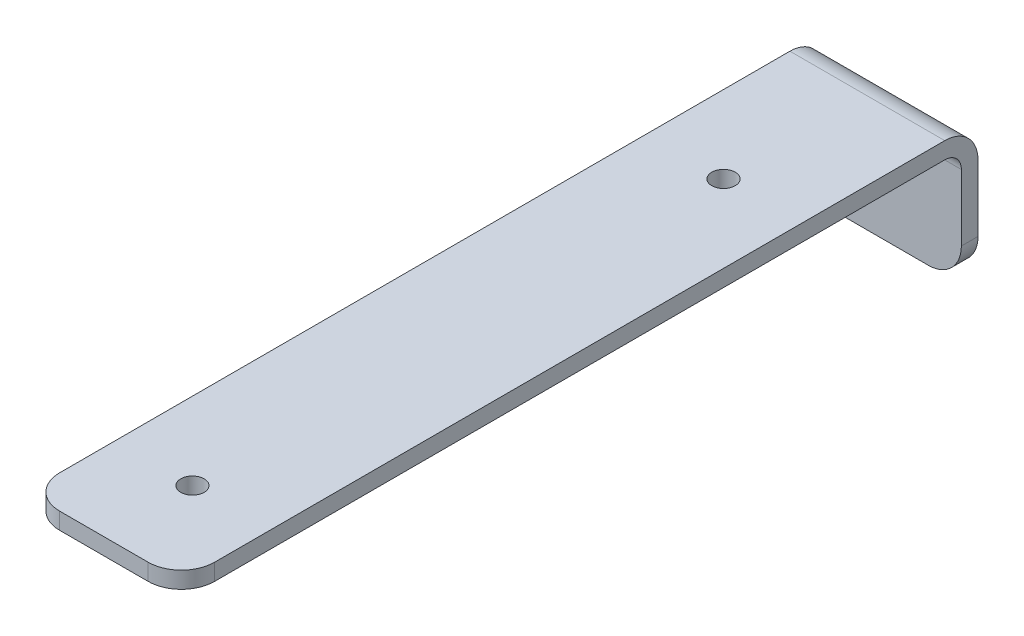
ISO-10303-21;
HEADER;
FILE_DESCRIPTION(('STEP AP214'),'2;1');
FILE_NAME('part.step','',(''),(''),'','','');
FILE_SCHEMA(('AUTOMOTIVE_DESIGN { 1 0 10303 214 1 1 1 1 }'));
ENDSEC;
DATA;
#1=APPLICATION_CONTEXT('core data for automotive mechanical design processes');
#2=APPLICATION_PROTOCOL_DEFINITION('international standard','automotive_design',2000,#1);
#3=PRODUCT_CONTEXT('',#1,'mechanical');
#4=PRODUCT('Part','Part','',(#3));
#5=PRODUCT_RELATED_PRODUCT_CATEGORY('part','',(#4));
#6=PRODUCT_DEFINITION_FORMATION('','',#4);
#7=PRODUCT_DEFINITION_CONTEXT('part definition',#1,'design');
#8=PRODUCT_DEFINITION('design','',#6,#7);
#9=PRODUCT_DEFINITION_SHAPE('','',#8);
#10=(LENGTH_UNIT() NAMED_UNIT(*) SI_UNIT(.MILLI.,.METRE.));
#11=(NAMED_UNIT(*) PLANE_ANGLE_UNIT() SI_UNIT($,.RADIAN.));
#12=(NAMED_UNIT(*) SI_UNIT($,.STERADIAN.) SOLID_ANGLE_UNIT());
#13=UNCERTAINTY_MEASURE_WITH_UNIT(LENGTH_MEASURE(1.E-05),#10,'distance_accuracy_value','');
#14=(GEOMETRIC_REPRESENTATION_CONTEXT(3) GLOBAL_UNCERTAINTY_ASSIGNED_CONTEXT((#13)) GLOBAL_UNIT_ASSIGNED_CONTEXT((#10,
#11,#12)) REPRESENTATION_CONTEXT('',''));
#15=CARTESIAN_POINT('',(0.,0.,0.));
#16=DIRECTION('',(0.,0.,1.));
#17=DIRECTION('',(1.,0.,0.));
#18=AXIS2_PLACEMENT_3D('',#15,#16,#17);
#19=CARTESIAN_POINT('',(44.45,0.,-4.7752));
#20=DIRECTION('',(0.,1.,0.));
#21=DIRECTION('',(0.,0.,1.));
#22=AXIS2_PLACEMENT_3D('',#19,#20,#21);
#23=PLANE('',#22);
#24=DIRECTION('',(-1.,0.,0.));
#25=VECTOR('',#24,1.);
#26=CARTESIAN_POINT('',(44.45,0.,0.));
#27=LINE('',#26,#25);
#28=CARTESIAN_POINT('',(34.925,0.,0.));
#29=VERTEX_POINT('',#28);
#30=CARTESIAN_POINT('',(9.525,0.,0.));
#31=VERTEX_POINT('',#30);
#32=EDGE_CURVE('E159',#29,#31,#27,.T.);
#33=ORIENTED_EDGE('',*,*,#32,.T.);
#34=DIRECTION('',(0.,0.,-1.));
#35=VECTOR('',#34,1.);
#36=CARTESIAN_POINT('',(9.525,0.,-4.7752));
#37=LINE('',#36,#35);
#38=CARTESIAN_POINT('',(9.525,0.,-4.7752));
#39=VERTEX_POINT('',#38);
#40=EDGE_CURVE('E184',#31,#39,#37,.T.);
#41=ORIENTED_EDGE('',*,*,#40,.T.);
#42=DIRECTION('',(-1.,0.,0.));
#43=VECTOR('',#42,1.);
#44=CARTESIAN_POINT('',(44.45,0.,-4.7752));
#45=LINE('',#44,#43);
#46=CARTESIAN_POINT('',(34.925,0.,-4.7752));
#47=VERTEX_POINT('',#46);
#48=EDGE_CURVE('E144',#47,#39,#45,.T.);
#49=ORIENTED_EDGE('',*,*,#48,.F.);
#50=DIRECTION('',(0.,0.,-1.));
#51=VECTOR('',#50,1.);
#52=CARTESIAN_POINT('',(34.925,0.,-4.7752));
#53=LINE('',#52,#51);
#54=EDGE_CURVE('E182',#47,#29,#53,.F.);
#55=ORIENTED_EDGE('',*,*,#54,.T.);
#56=EDGE_LOOP('',(#33,#41,#49,#55));
#57=FACE_BOUND('',#56,.T.);
#58=ADVANCED_FACE('F32',(#57),#23,.F.);
#59=CARTESIAN_POINT('',(44.45,38.1,-4.7752));
#60=DIRECTION('',(0.,0.,1.));
#61=DIRECTION('',(0.,-1.,0.));
#62=AXIS2_PLACEMENT_3D('',#59,#60,#61);
#63=PLANE('',#62);
#64=ORIENTED_EDGE('',*,*,#48,.T.);
#65=CARTESIAN_POINT('',(9.525,9.525,-4.7752));
#66=DIRECTION('',(0.,0.,1.));
#67=DIRECTION('',(0.,-1.,0.));
#68=AXIS2_PLACEMENT_3D('',#65,#66,#67);
#69=CIRCLE('',#68,9.525);
#70=CARTESIAN_POINT('',(0.,9.52500000000001,-4.7752));
#71=VERTEX_POINT('',#70);
#72=EDGE_CURVE('E189',#39,#71,#69,.F.);
#73=ORIENTED_EDGE('',*,*,#72,.T.);
#74=DIRECTION('',(0.,1.,0.));
#75=VECTOR('',#74,1.);
#76=CARTESIAN_POINT('',(0.,38.1,-4.7752));
#77=LINE('',#76,#75);
#78=CARTESIAN_POINT('',(0.,28.575,-4.7752));
#79=VERTEX_POINT('',#78);
#80=EDGE_CURVE('E218',#71,#79,#77,.T.);
#81=ORIENTED_EDGE('',*,*,#80,.T.);
#82=DIRECTION('',(-1.,0.,0.));
#83=VECTOR('',#82,1.);
#84=CARTESIAN_POINT('',(44.45,28.575,-4.7752));
#85=LINE('',#84,#83);
#86=CARTESIAN_POINT('',(44.45,28.575,-4.7752));
#87=VERTEX_POINT('',#86);
#88=EDGE_CURVE('E177',#79,#87,#85,.F.);
#89=ORIENTED_EDGE('',*,*,#88,.T.);
#90=DIRECTION('',(0.,1.,0.));
#91=VECTOR('',#90,1.);
#92=CARTESIAN_POINT('',(44.45,38.1,-4.7752));
#93=LINE('',#92,#91);
#94=CARTESIAN_POINT('',(44.45,9.52500000000001,-4.7752));
#95=VERTEX_POINT('',#94);
#96=EDGE_CURVE('E150',#95,#87,#93,.T.);
#97=ORIENTED_EDGE('',*,*,#96,.F.);
#98=CARTESIAN_POINT('',(34.925,9.525,-4.7752));
#99=DIRECTION('',(0.,0.,1.));
#100=DIRECTION('',(0.,-1.,0.));
#101=AXIS2_PLACEMENT_3D('',#98,#99,#100);
#102=CIRCLE('',#101,9.525);
#103=EDGE_CURVE('E187',#95,#47,#102,.F.);
#104=ORIENTED_EDGE('',*,*,#103,.T.);
#105=EDGE_LOOP('',(#64,#73,#81,#89,#97,#104));
#106=FACE_BOUND('',#105,.T.);
#107=ADVANCED_FACE('F266',(#106),#63,.F.);
#108=CARTESIAN_POINT('',(44.45,38.1,223.8248));
#109=DIRECTION('',(0.,-1.,0.));
#110=DIRECTION('',(0.,0.,-1.));
#111=AXIS2_PLACEMENT_3D('',#108,#109,#110);
#112=PLANE('',#111);
#113=CARTESIAN_POINT('',(22.225,38.1,198.4248));
#114=DIRECTION('',(0.,1.,0.));
#115=DIRECTION('',(0.,0.,1.));
#116=AXIS2_PLACEMENT_3D('',#113,#114,#115);
#117=CIRCLE('',#116,3.3655);
#118=CARTESIAN_POINT('',(22.225,38.1,201.7903));
#119=VERTEX_POINT('',#118);
#120=EDGE_CURVE('E214',#119,#119,#117,.T.);
#121=ORIENTED_EDGE('',*,*,#120,.F.);
#122=EDGE_LOOP('',(#121));
#123=FACE_BOUND('',#122,.T.);
#124=CARTESIAN_POINT('',(22.225,38.1,46.0248));
#125=DIRECTION('',(0.,1.,0.));
#126=DIRECTION('',(0.,0.,1.));
#127=AXIS2_PLACEMENT_3D('',#124,#125,#126);
#128=CIRCLE('',#127,3.3655);
#129=CARTESIAN_POINT('',(22.225,38.1,49.3903));
#130=VERTEX_POINT('',#129);
#131=EDGE_CURVE('E220',#130,#130,#128,.T.);
#132=ORIENTED_EDGE('',*,*,#131,.F.);
#133=EDGE_LOOP('',(#132));
#134=FACE_BOUND('',#133,.T.);
#135=DIRECTION('',(0.,0.,1.));
#136=VECTOR('',#135,1.);
#137=CARTESIAN_POINT('',(0.,38.1,223.8248));
#138=LINE('',#137,#136);
#139=CARTESIAN_POINT('',(0.,38.1,4.7498));
#140=VERTEX_POINT('',#139);
#141=CARTESIAN_POINT('',(0.,38.1,214.2998));
#142=VERTEX_POINT('',#141);
#143=EDGE_CURVE('E155',#140,#142,#138,.T.);
#144=ORIENTED_EDGE('',*,*,#143,.T.);
#145=CARTESIAN_POINT('',(9.525,38.1,214.2998));
#146=DIRECTION('',(0.,-1.,0.));
#147=DIRECTION('',(0.,0.,-1.));
#148=AXIS2_PLACEMENT_3D('',#145,#146,#147);
#149=CIRCLE('',#148,9.525);
#150=CARTESIAN_POINT('',(9.525,38.1,223.8248));
#151=VERTEX_POINT('',#150);
#152=EDGE_CURVE('E11',#142,#151,#149,.F.);
#153=ORIENTED_EDGE('',*,*,#152,.T.);
#154=DIRECTION('',(-1.,0.,0.));
#155=VECTOR('',#154,1.);
#156=CARTESIAN_POINT('',(44.45,38.1,223.8248));
#157=LINE('',#156,#155);
#158=CARTESIAN_POINT('',(34.925,38.1,223.8248));
#159=VERTEX_POINT('',#158);
#160=EDGE_CURVE('E165',#159,#151,#157,.T.);
#161=ORIENTED_EDGE('',*,*,#160,.F.);
#162=CARTESIAN_POINT('',(34.925,38.1,214.2998));
#163=DIRECTION('',(0.,-1.,0.));
#164=DIRECTION('',(0.,0.,-1.));
#165=AXIS2_PLACEMENT_3D('',#162,#163,#164);
#166=CIRCLE('',#165,9.525);
#167=CARTESIAN_POINT('',(44.45,38.1,214.2998));
#168=VERTEX_POINT('',#167);
#169=EDGE_CURVE('E41',#159,#168,#166,.F.);
#170=ORIENTED_EDGE('',*,*,#169,.T.);
#171=DIRECTION('',(0.,0.,1.));
#172=VECTOR('',#171,1.);
#173=CARTESIAN_POINT('',(44.45,38.1,223.8248));
#174=LINE('',#173,#172);
#175=CARTESIAN_POINT('',(44.45,38.1,4.7498));
#176=VERTEX_POINT('',#175);
#177=EDGE_CURVE('E153',#176,#168,#174,.T.);
#178=ORIENTED_EDGE('',*,*,#177,.F.);
#179=DIRECTION('',(-1.,0.,0.));
#180=VECTOR('',#179,1.);
#181=CARTESIAN_POINT('',(44.45,38.1,4.7498));
#182=LINE('',#181,#180);
#183=EDGE_CURVE('E171',#176,#140,#182,.T.);
#184=ORIENTED_EDGE('',*,*,#183,.T.);
#185=EDGE_LOOP('',(#144,#153,#161,#170,#178,#184));
#186=FACE_BOUND('',#185,.T.);
#187=ADVANCED_FACE('F233',(#123,#134,#186),#112,.F.);
#188=CARTESIAN_POINT('',(44.45,33.3248,223.8248));
#189=DIRECTION('',(0.,0.,-1.));
#190=DIRECTION('',(-1.,0.,0.));
#191=AXIS2_PLACEMENT_3D('',#188,#189,#190);
#192=PLANE('',#191);
#193=ORIENTED_EDGE('',*,*,#160,.T.);
#194=DIRECTION('',(0.,-1.,0.));
#195=VECTOR('',#194,1.);
#196=CARTESIAN_POINT('',(9.525,33.3248,223.8248));
#197=LINE('',#196,#195);
#198=CARTESIAN_POINT('',(9.525,33.3248,223.8248));
#199=VERTEX_POINT('',#198);
#200=EDGE_CURVE('E205',#151,#199,#197,.T.);
#201=ORIENTED_EDGE('',*,*,#200,.T.);
#202=DIRECTION('',(-1.,0.,0.));
#203=VECTOR('',#202,1.);
#204=CARTESIAN_POINT('',(44.45,33.3248,223.8248));
#205=LINE('',#204,#203);
#206=CARTESIAN_POINT('',(34.925,33.3248,223.8248));
#207=VERTEX_POINT('',#206);
#208=EDGE_CURVE('E162',#207,#199,#205,.T.);
#209=ORIENTED_EDGE('',*,*,#208,.F.);
#210=DIRECTION('',(0.,-1.,0.));
#211=VECTOR('',#210,1.);
#212=CARTESIAN_POINT('',(34.925,33.3248,223.8248));
#213=LINE('',#212,#211);
#214=EDGE_CURVE('E54',#207,#159,#213,.F.);
#215=ORIENTED_EDGE('',*,*,#214,.T.);
#216=EDGE_LOOP('',(#193,#201,#209,#215));
#217=FACE_BOUND('',#216,.T.);
#218=ADVANCED_FACE('F240',(#217),#192,.F.);
#219=CARTESIAN_POINT('',(44.45,33.3248,0.));
#220=DIRECTION('',(0.,1.,0.));
#221=DIRECTION('',(0.,0.,1.));
#222=AXIS2_PLACEMENT_3D('',#219,#220,#221);
#223=PLANE('',#222);
#224=CARTESIAN_POINT('',(22.225,33.3248,198.4248));
#225=DIRECTION('',(0.,1.,0.));
#226=DIRECTION('',(0.,0.,1.));
#227=AXIS2_PLACEMENT_3D('',#224,#225,#226);
#228=CIRCLE('',#227,3.3655);
#229=CARTESIAN_POINT('',(22.225,33.3248,201.7903));
#230=VERTEX_POINT('',#229);
#231=EDGE_CURVE('E36',#230,#230,#228,.T.);
#232=ORIENTED_EDGE('',*,*,#231,.T.);
#233=EDGE_LOOP('',(#232));
#234=FACE_BOUND('',#233,.T.);
#235=CARTESIAN_POINT('',(22.225,33.3248,46.0248));
#236=DIRECTION('',(0.,1.,0.));
#237=DIRECTION('',(0.,0.,1.));
#238=AXIS2_PLACEMENT_3D('',#235,#236,#237);
#239=CIRCLE('',#238,3.3655);
#240=CARTESIAN_POINT('',(22.225,33.3248,49.3903));
#241=VERTEX_POINT('',#240);
#242=EDGE_CURVE('E212',#241,#241,#239,.T.);
#243=ORIENTED_EDGE('',*,*,#242,.T.);
#244=EDGE_LOOP('',(#243));
#245=FACE_BOUND('',#244,.T.);
#246=ORIENTED_EDGE('',*,*,#208,.T.);
#247=CARTESIAN_POINT('',(9.525,33.3248,214.2998));
#248=DIRECTION('',(0.,1.,0.));
#249=DIRECTION('',(0.,0.,1.));
#250=AXIS2_PLACEMENT_3D('',#247,#248,#249);
#251=CIRCLE('',#250,9.525);
#252=CARTESIAN_POINT('',(0.,33.3248,214.2998));
#253=VERTEX_POINT('',#252);
#254=EDGE_CURVE('E210',#199,#253,#251,.F.);
#255=ORIENTED_EDGE('',*,*,#254,.T.);
#256=DIRECTION('',(0.,0.,-1.));
#257=VECTOR('',#256,1.);
#258=CARTESIAN_POINT('',(0.,33.3248,0.));
#259=LINE('',#258,#257);
#260=CARTESIAN_POINT('',(0.,33.3248,4.7752));
#261=VERTEX_POINT('',#260);
#262=EDGE_CURVE('E151',#253,#261,#259,.T.);
#263=ORIENTED_EDGE('',*,*,#262,.T.);
#264=DIRECTION('',(-1.,0.,0.));
#265=VECTOR('',#264,1.);
#266=CARTESIAN_POINT('',(44.45,33.3248,4.7752));
#267=LINE('',#266,#265);
#268=CARTESIAN_POINT('',(44.45,33.3248,4.7752));
#269=VERTEX_POINT('',#268);
#270=EDGE_CURVE('E130',#261,#269,#267,.F.);
#271=ORIENTED_EDGE('',*,*,#270,.T.);
#272=DIRECTION('',(0.,0.,-1.));
#273=VECTOR('',#272,1.);
#274=CARTESIAN_POINT('',(44.45,33.3248,0.));
#275=LINE('',#274,#273);
#276=CARTESIAN_POINT('',(44.45,33.3248,214.2998));
#277=VERTEX_POINT('',#276);
#278=EDGE_CURVE('E229',#277,#269,#275,.T.);
#279=ORIENTED_EDGE('',*,*,#278,.F.);
#280=CARTESIAN_POINT('',(34.925,33.3248,214.2998));
#281=DIRECTION('',(0.,1.,0.));
#282=DIRECTION('',(0.,0.,1.));
#283=AXIS2_PLACEMENT_3D('',#280,#281,#282);
#284=CIRCLE('',#283,9.525);
#285=EDGE_CURVE('E208',#277,#207,#284,.F.);
#286=ORIENTED_EDGE('',*,*,#285,.T.);
#287=EDGE_LOOP('',(#246,#255,#263,#271,#279,#286));
#288=FACE_BOUND('',#287,.T.);
#289=ADVANCED_FACE('F242',(#234,#245,#288),#223,.F.);
#290=CARTESIAN_POINT('',(44.45,0.,0.));
#291=DIRECTION('',(0.,0.,-1.));
#292=DIRECTION('',(0.,1.,0.));
#293=AXIS2_PLACEMENT_3D('',#290,#291,#292);
#294=PLANE('',#293);
#295=DIRECTION('',(0.,-1.,0.));
#296=VECTOR('',#295,1.);
#297=CARTESIAN_POINT('',(0.,0.,0.));
#298=LINE('',#297,#296);
#299=CARTESIAN_POINT('',(0.,28.5496,0.));
#300=VERTEX_POINT('',#299);
#301=CARTESIAN_POINT('',(0.,9.525,0.));
#302=VERTEX_POINT('',#301);
#303=EDGE_CURVE('E140',#300,#302,#298,.T.);
#304=ORIENTED_EDGE('',*,*,#303,.T.);
#305=CARTESIAN_POINT('',(9.525,9.525,0.));
#306=DIRECTION('',(0.,0.,-1.));
#307=DIRECTION('',(0.,1.,0.));
#308=AXIS2_PLACEMENT_3D('',#305,#306,#307);
#309=CIRCLE('',#308,9.525);
#310=EDGE_CURVE('E196',#302,#31,#309,.F.);
#311=ORIENTED_EDGE('',*,*,#310,.T.);
#312=ORIENTED_EDGE('',*,*,#32,.F.);
#313=CARTESIAN_POINT('',(34.925,9.525,0.));
#314=DIRECTION('',(0.,0.,-1.));
#315=DIRECTION('',(0.,1.,0.));
#316=AXIS2_PLACEMENT_3D('',#313,#314,#315);
#317=CIRCLE('',#316,9.525);
#318=CARTESIAN_POINT('',(44.45,9.525,0.));
#319=VERTEX_POINT('',#318);
#320=EDGE_CURVE('E194',#29,#319,#317,.F.);
#321=ORIENTED_EDGE('',*,*,#320,.T.);
#322=DIRECTION('',(0.,-1.,0.));
#323=VECTOR('',#322,1.);
#324=CARTESIAN_POINT('',(44.45,0.,0.));
#325=LINE('',#324,#323);
#326=CARTESIAN_POINT('',(44.45,28.5496,0.));
#327=VERTEX_POINT('',#326);
#328=EDGE_CURVE('E143',#327,#319,#325,.T.);
#329=ORIENTED_EDGE('',*,*,#328,.F.);
#330=DIRECTION('',(-1.,0.,0.));
#331=VECTOR('',#330,1.);
#332=CARTESIAN_POINT('',(0.,28.5496,0.));
#333=LINE('',#332,#331);
#334=EDGE_CURVE('E128',#327,#300,#333,.T.);
#335=ORIENTED_EDGE('',*,*,#334,.T.);
#336=EDGE_LOOP('',(#304,#311,#312,#321,#329,#335));
#337=FACE_BOUND('',#336,.T.);
#338=ADVANCED_FACE('F139',(#337),#294,.F.);
#339=CARTESIAN_POINT('',(44.45,0.,0.));
#340=DIRECTION('',(-1.,0.,0.));
#341=DIRECTION('',(0.,0.,1.));
#342=AXIS2_PLACEMENT_3D('',#339,#340,#341);
#343=PLANE('',#342);
#344=ORIENTED_EDGE('',*,*,#328,.T.);
#345=DIRECTION('',(0.,0.,-1.));
#346=VECTOR('',#345,1.);
#347=CARTESIAN_POINT('',(44.45,9.525,0.));
#348=LINE('',#347,#346);
#349=EDGE_CURVE('E201',#319,#95,#348,.T.);
#350=ORIENTED_EDGE('',*,*,#349,.T.);
#351=ORIENTED_EDGE('',*,*,#96,.T.);
#352=CARTESIAN_POINT('',(44.45,28.575,4.7498));
#353=DIRECTION('',(-1.,0.,0.));
#354=DIRECTION('',(0.,0.,1.));
#355=AXIS2_PLACEMENT_3D('',#352,#353,#354);
#356=CIRCLE('',#355,9.525);
#357=EDGE_CURVE('E180',#87,#176,#356,.F.);
#358=ORIENTED_EDGE('',*,*,#357,.T.);
#359=ORIENTED_EDGE('',*,*,#177,.T.);
#360=DIRECTION('',(0.,-1.,0.));
#361=VECTOR('',#360,1.);
#362=CARTESIAN_POINT('',(44.45,0.,214.2998));
#363=LINE('',#362,#361);
#364=EDGE_CURVE('E198',#168,#277,#363,.T.);
#365=ORIENTED_EDGE('',*,*,#364,.T.);
#366=ORIENTED_EDGE('',*,*,#278,.T.);
#367=CARTESIAN_POINT('',(44.45,28.5496,4.7752));
#368=DIRECTION('',(-1.,0.,0.));
#369=DIRECTION('',(0.,0.,1.));
#370=AXIS2_PLACEMENT_3D('',#367,#368,#369);
#371=CIRCLE('',#370,4.7752);
#372=EDGE_CURVE('E134',#269,#327,#371,.T.);
#373=ORIENTED_EDGE('',*,*,#372,.T.);
#374=EDGE_LOOP('',(#344,#350,#351,#358,#359,#365,#366,#373));
#375=FACE_BOUND('',#374,.T.);
#376=ADVANCED_FACE('F248',(#375),#343,.F.);
#377=CARTESIAN_POINT('',(0.,0.,0.));
#378=DIRECTION('',(-1.,0.,0.));
#379=DIRECTION('',(0.,0.,1.));
#380=AXIS2_PLACEMENT_3D('',#377,#378,#379);
#381=PLANE('',#380);
#382=ORIENTED_EDGE('',*,*,#80,.F.);
#383=DIRECTION('',(0.,0.,-1.));
#384=VECTOR('',#383,1.);
#385=CARTESIAN_POINT('',(0.,9.525,0.));
#386=LINE('',#385,#384);
#387=EDGE_CURVE('E149',#71,#302,#386,.F.);
#388=ORIENTED_EDGE('',*,*,#387,.T.);
#389=ORIENTED_EDGE('',*,*,#303,.F.);
#390=CARTESIAN_POINT('',(0.,28.5496,4.7752));
#391=DIRECTION('',(-1.,0.,0.));
#392=DIRECTION('',(0.,0.,1.));
#393=AXIS2_PLACEMENT_3D('',#390,#391,#392);
#394=CIRCLE('',#393,4.7752);
#395=EDGE_CURVE('E124',#300,#261,#394,.F.);
#396=ORIENTED_EDGE('',*,*,#395,.T.);
#397=ORIENTED_EDGE('',*,*,#262,.F.);
#398=DIRECTION('',(0.,-1.,0.));
#399=VECTOR('',#398,1.);
#400=CARTESIAN_POINT('',(0.,38.1,214.2998));
#401=LINE('',#400,#399);
#402=EDGE_CURVE('E191',#253,#142,#401,.F.);
#403=ORIENTED_EDGE('',*,*,#402,.T.);
#404=ORIENTED_EDGE('',*,*,#143,.F.);
#405=CARTESIAN_POINT('',(0.,28.575,4.7498));
#406=DIRECTION('',(-1.,0.,0.));
#407=DIRECTION('',(0.,0.,1.));
#408=AXIS2_PLACEMENT_3D('',#405,#406,#407);
#409=CIRCLE('',#408,9.525);
#410=EDGE_CURVE('E174',#140,#79,#409,.T.);
#411=ORIENTED_EDGE('',*,*,#410,.T.);
#412=EDGE_LOOP('',(#382,#388,#389,#396,#397,#403,#404,#411));
#413=FACE_BOUND('',#412,.T.);
#414=ADVANCED_FACE('F147',(#413),#381,.T.);
#415=CARTESIAN_POINT('',(44.45,28.5496,4.7752));
#416=DIRECTION('',(1.,0.,0.));
#417=DIRECTION('',(0.,0.,-1.));
#418=AXIS2_PLACEMENT_3D('',#415,#416,#417);
#419=CYLINDRICAL_SURFACE('',#418,4.7752);
#420=ORIENTED_EDGE('',*,*,#372,.F.);
#421=ORIENTED_EDGE('',*,*,#270,.F.);
#422=ORIENTED_EDGE('',*,*,#395,.F.);
#423=ORIENTED_EDGE('',*,*,#334,.F.);
#424=EDGE_LOOP('',(#420,#421,#422,#423));
#425=FACE_BOUND('',#424,.T.);
#426=ADVANCED_FACE('F127',(#425),#419,.F.);
#427=CARTESIAN_POINT('',(44.45,28.575,4.7498));
#428=DIRECTION('',(-1.,0.,0.));
#429=DIRECTION('',(0.,0.,1.));
#430=AXIS2_PLACEMENT_3D('',#427,#428,#429);
#431=CYLINDRICAL_SURFACE('',#430,9.525);
#432=ORIENTED_EDGE('',*,*,#357,.F.);
#433=ORIENTED_EDGE('',*,*,#88,.F.);
#434=ORIENTED_EDGE('',*,*,#410,.F.);
#435=ORIENTED_EDGE('',*,*,#183,.F.);
#436=EDGE_LOOP('',(#432,#433,#434,#435));
#437=FACE_BOUND('',#436,.T.);
#438=ADVANCED_FACE('F251',(#437),#431,.T.);
#439=CARTESIAN_POINT('',(9.525,9.525,-4.7752));
#440=DIRECTION('',(0.,0.,1.));
#441=DIRECTION('',(0.,-1.,0.));
#442=AXIS2_PLACEMENT_3D('',#439,#440,#441);
#443=CYLINDRICAL_SURFACE('',#442,9.525);
#444=ORIENTED_EDGE('',*,*,#310,.F.);
#445=ORIENTED_EDGE('',*,*,#387,.F.);
#446=ORIENTED_EDGE('',*,*,#72,.F.);
#447=ORIENTED_EDGE('',*,*,#40,.F.);
#448=EDGE_LOOP('',(#444,#445,#446,#447));
#449=FACE_BOUND('',#448,.T.);
#450=ADVANCED_FACE('F255',(#449),#443,.T.);
#451=CARTESIAN_POINT('',(34.925,9.525,0.));
#452=DIRECTION('',(0.,0.,-1.));
#453=DIRECTION('',(0.,1.,0.));
#454=AXIS2_PLACEMENT_3D('',#451,#452,#453);
#455=CYLINDRICAL_SURFACE('',#454,9.525);
#456=ORIENTED_EDGE('',*,*,#320,.F.);
#457=ORIENTED_EDGE('',*,*,#54,.F.);
#458=ORIENTED_EDGE('',*,*,#103,.F.);
#459=ORIENTED_EDGE('',*,*,#349,.F.);
#460=EDGE_LOOP('',(#456,#457,#458,#459));
#461=FACE_BOUND('',#460,.T.);
#462=ADVANCED_FACE('F263',(#461),#455,.T.);
#463=CARTESIAN_POINT('',(9.525,33.3248,214.2998));
#464=DIRECTION('',(0.,1.,0.));
#465=DIRECTION('',(0.,0.,1.));
#466=AXIS2_PLACEMENT_3D('',#463,#464,#465);
#467=CYLINDRICAL_SURFACE('',#466,9.525);
#468=ORIENTED_EDGE('',*,*,#152,.F.);
#469=ORIENTED_EDGE('',*,*,#402,.F.);
#470=ORIENTED_EDGE('',*,*,#254,.F.);
#471=ORIENTED_EDGE('',*,*,#200,.F.);
#472=EDGE_LOOP('',(#468,#469,#470,#471));
#473=FACE_BOUND('',#472,.T.);
#474=ADVANCED_FACE('F239',(#473),#467,.T.);
#475=CARTESIAN_POINT('',(34.925,0.,214.2998));
#476=DIRECTION('',(0.,-1.,0.));
#477=DIRECTION('',(0.,0.,-1.));
#478=AXIS2_PLACEMENT_3D('',#475,#476,#477);
#479=CYLINDRICAL_SURFACE('',#478,9.525);
#480=ORIENTED_EDGE('',*,*,#169,.F.);
#481=ORIENTED_EDGE('',*,*,#214,.F.);
#482=ORIENTED_EDGE('',*,*,#285,.F.);
#483=ORIENTED_EDGE('',*,*,#364,.F.);
#484=EDGE_LOOP('',(#480,#481,#482,#483));
#485=FACE_BOUND('',#484,.T.);
#486=ADVANCED_FACE('F34',(#485),#479,.T.);
#487=CARTESIAN_POINT('',(22.225,0.,46.0248));
#488=DIRECTION('',(0.,1.,0.));
#489=DIRECTION('',(0.,0.,1.));
#490=AXIS2_PLACEMENT_3D('',#487,#488,#489);
#491=CYLINDRICAL_SURFACE('',#490,3.3655);
#492=ORIENTED_EDGE('',*,*,#131,.T.);
#493=EDGE_LOOP('',(#492));
#494=FACE_BOUND('',#493,.T.);
#495=ORIENTED_EDGE('',*,*,#242,.F.);
#496=EDGE_LOOP('',(#495));
#497=FACE_BOUND('',#496,.T.);
#498=ADVANCED_FACE('F289',(#494,#497),#491,.F.);
#499=CARTESIAN_POINT('',(22.225,0.,198.4248));
#500=DIRECTION('',(0.,1.,0.));
#501=DIRECTION('',(0.,0.,1.));
#502=AXIS2_PLACEMENT_3D('',#499,#500,#501);
#503=CYLINDRICAL_SURFACE('',#502,3.3655);
#504=ORIENTED_EDGE('',*,*,#120,.T.);
#505=EDGE_LOOP('',(#504));
#506=FACE_BOUND('',#505,.T.);
#507=ORIENTED_EDGE('',*,*,#231,.F.);
#508=EDGE_LOOP('',(#507));
#509=FACE_BOUND('',#508,.T.);
#510=ADVANCED_FACE('F293',(#506,#509),#503,.F.);
#511=CLOSED_SHELL('',(#58,#107,#187,#218,#289,#338,#376,#414,#426,#438,#450,#462,#474,#486,#498,#510));
#512=MANIFOLD_SOLID_BREP('B2',#511);
#513=ADVANCED_BREP_SHAPE_REPRESENTATION('',(#18,#512),#14);
#514=SHAPE_DEFINITION_REPRESENTATION(#9,#513);
ENDSEC;
END-ISO-10303-21;
